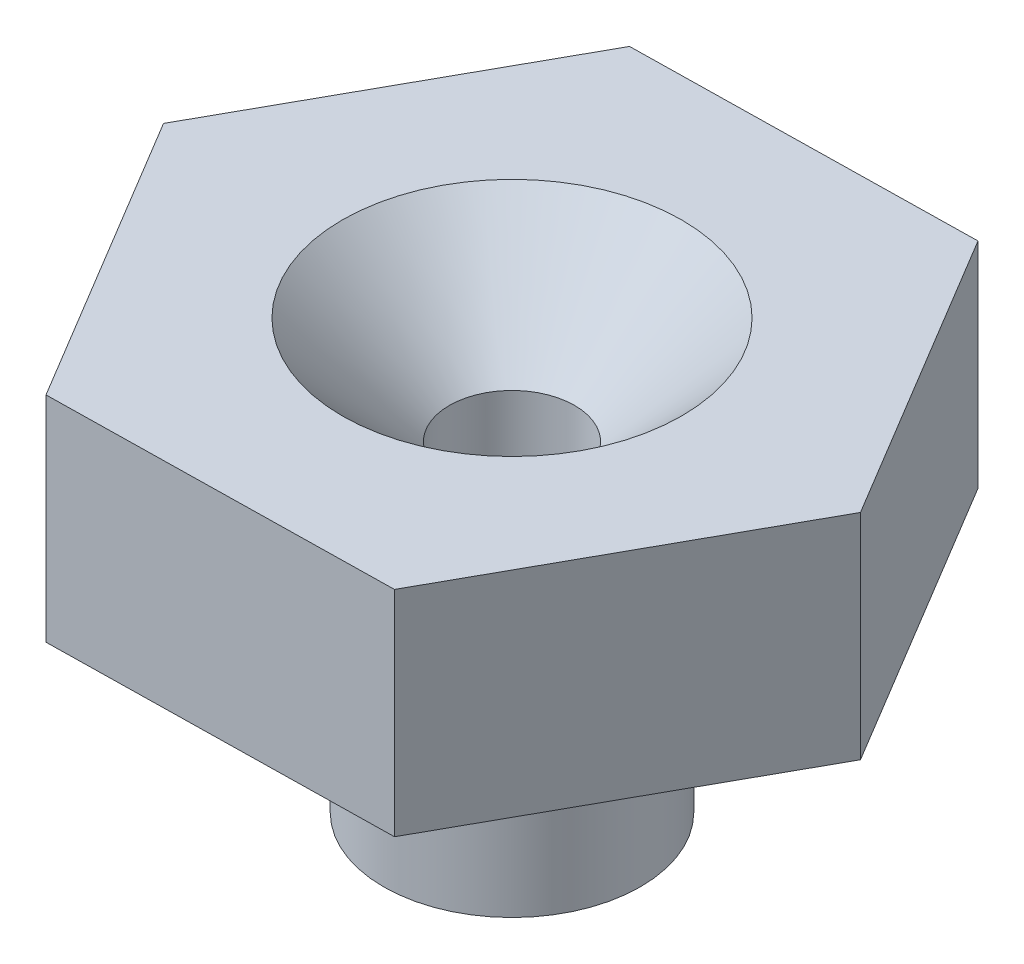
ISO-10303-21;
HEADER;
FILE_DESCRIPTION(('STEP AP214'),'2;1');
FILE_NAME('part.step','',(''),(''),'','','');
FILE_SCHEMA(('AUTOMOTIVE_DESIGN { 1 0 10303 214 1 1 1 1 }'));
ENDSEC;
DATA;
#1=APPLICATION_CONTEXT('core data for automotive mechanical design processes');
#2=APPLICATION_PROTOCOL_DEFINITION('international standard','automotive_design',2000,#1);
#3=PRODUCT_CONTEXT('',#1,'mechanical');
#4=PRODUCT('Part','Part','',(#3));
#5=PRODUCT_RELATED_PRODUCT_CATEGORY('part','',(#4));
#6=PRODUCT_DEFINITION_FORMATION('','',#4);
#7=PRODUCT_DEFINITION_CONTEXT('part definition',#1,'design');
#8=PRODUCT_DEFINITION('design','',#6,#7);
#9=PRODUCT_DEFINITION_SHAPE('','',#8);
#10=(LENGTH_UNIT() NAMED_UNIT(*) SI_UNIT(.MILLI.,.METRE.));
#11=(NAMED_UNIT(*) PLANE_ANGLE_UNIT() SI_UNIT($,.RADIAN.));
#12=(NAMED_UNIT(*) SI_UNIT($,.STERADIAN.) SOLID_ANGLE_UNIT());
#13=UNCERTAINTY_MEASURE_WITH_UNIT(LENGTH_MEASURE(1.E-05),#10,'distance_accuracy_value','');
#14=(GEOMETRIC_REPRESENTATION_CONTEXT(3) GLOBAL_UNCERTAINTY_ASSIGNED_CONTEXT((#13)) GLOBAL_UNIT_ASSIGNED_CONTEXT((#10,
#11,#12)) REPRESENTATION_CONTEXT('',''));
#15=CARTESIAN_POINT('',(0.,0.,0.));
#16=DIRECTION('',(0.,0.,1.));
#17=DIRECTION('',(1.,0.,0.));
#18=AXIS2_PLACEMENT_3D('',#15,#16,#17);
#19=CARTESIAN_POINT('',(-0.23391674633456,10.,-13.8544318885975));
#20=DIRECTION('',(0.0168814870580272,0.,0.999857497543894));
#21=DIRECTION('',(0.999857497543894,0.,-0.0168814870580272));
#22=AXIS2_PLACEMENT_3D('',#19,#20,#21);
#23=PLANE('',#22);
#24=DIRECTION('',(-0.999857497543894,0.,0.0168814870580272));
#25=VECTOR('',#24,1.);
#26=CARTESIAN_POINT('',(-0.233916746334582,0.,-13.8544318885976));
#27=LINE('',#26,#25);
#28=CARTESIAN_POINT('',(7.76494323401657,0.,-13.9894837850619));
#29=VERTEX_POINT('',#28);
#30=CARTESIAN_POINT('',(-8.23277672668571,0.,-13.7193799921332));
#31=VERTEX_POINT('',#30);
#32=EDGE_CURVE('E135',#29,#31,#27,.T.);
#33=ORIENTED_EDGE('',*,*,#32,.T.);
#34=DIRECTION('',(0.,-1.,0.));
#35=VECTOR('',#34,1.);
#36=CARTESIAN_POINT('',(-8.23277672668571,10.,-13.7193799921332));
#37=LINE('',#36,#35);
#38=CARTESIAN_POINT('',(-8.23277672668571,10.,-13.7193799921332));
#39=VERTEX_POINT('',#38);
#40=EDGE_CURVE('E163',#39,#31,#37,.T.);
#41=ORIENTED_EDGE('',*,*,#40,.F.);
#42=DIRECTION('',(-0.999857497543894,0.,0.0168814870580272));
#43=VECTOR('',#42,1.);
#44=CARTESIAN_POINT('',(-0.23391674633456,10.,-13.8544318885975));
#45=LINE('',#44,#43);
#46=CARTESIAN_POINT('',(7.76494323401657,10.,-13.9894837850619));
#47=VERTEX_POINT('',#46);
#48=EDGE_CURVE('E152',#47,#39,#45,.T.);
#49=ORIENTED_EDGE('',*,*,#48,.F.);
#50=DIRECTION('',(0.,-1.,0.));
#51=VECTOR('',#50,1.);
#52=CARTESIAN_POINT('',(7.76494323401657,10.,-13.9894837850619));
#53=LINE('',#52,#51);
#54=EDGE_CURVE('E131',#47,#29,#53,.T.);
#55=ORIENTED_EDGE('',*,*,#54,.T.);
#56=EDGE_LOOP('',(#33,#41,#49,#55));
#57=FACE_BOUND('',#56,.T.);
#58=ADVANCED_FACE('F42',(#57),#23,.F.);
#59=CARTESIAN_POINT('',(-12.115248343694,10.,-6.72463809960256));
#60=DIRECTION('',(0.874342736566363,0.,0.485308952126038));
#61=DIRECTION('',(0.485308952126038,0.,-0.874342736566363));
#62=AXIS2_PLACEMENT_3D('',#59,#60,#61);
#63=PLANE('',#62);
#64=DIRECTION('',(-0.485308952126038,0.,0.874342736566363));
#65=VECTOR('',#64,1.);
#66=CARTESIAN_POINT('',(-12.1152483436941,0.,-6.72463809960253));
#67=LINE('',#66,#65);
#68=CARTESIAN_POINT('',(-15.9977199607024,0.,0.270103792928383));
#69=VERTEX_POINT('',#68);
#70=EDGE_CURVE('E139',#31,#69,#67,.T.);
#71=ORIENTED_EDGE('',*,*,#70,.T.);
#72=DIRECTION('',(0.,-1.,0.));
#73=VECTOR('',#72,1.);
#74=CARTESIAN_POINT('',(-15.9977199607024,10.,0.270103792928411));
#75=LINE('',#74,#73);
#76=CARTESIAN_POINT('',(-15.9977199607024,10.,0.270103792928411));
#77=VERTEX_POINT('',#76);
#78=EDGE_CURVE('E159',#77,#69,#75,.T.);
#79=ORIENTED_EDGE('',*,*,#78,.F.);
#80=DIRECTION('',(-0.485308952126038,0.,0.874342736566363));
#81=VECTOR('',#80,1.);
#82=CARTESIAN_POINT('',(-12.115248343694,10.,-6.72463809960256));
#83=LINE('',#82,#81);
#84=EDGE_CURVE('E99',#39,#77,#83,.T.);
#85=ORIENTED_EDGE('',*,*,#84,.F.);
#86=ORIENTED_EDGE('',*,*,#40,.T.);
#87=EDGE_LOOP('',(#71,#79,#85,#86));
#88=FACE_BOUND('',#87,.T.);
#89=ADVANCED_FACE('F189',(#88),#63,.F.);
#90=CARTESIAN_POINT('',(-11.8813315973595,10.,7.12979378899498));
#91=DIRECTION('',(0.857461249508335,0.,-0.514548545417857));
#92=DIRECTION('',(-0.514548545417857,0.,-0.857461249508335));
#93=AXIS2_PLACEMENT_3D('',#90,#91,#92);
#94=PLANE('',#93);
#95=DIRECTION('',(0.514548545417857,0.,0.857461249508335));
#96=VECTOR('',#95,1.);
#97=CARTESIAN_POINT('',(-11.8813315973595,0.,7.12979378899498));
#98=LINE('',#97,#96);
#99=CARTESIAN_POINT('',(-7.76494323401664,-1.11022302462516E-13,13.9894837850618));
#100=VERTEX_POINT('',#99);
#101=EDGE_CURVE('E143',#69,#100,#98,.T.);
#102=ORIENTED_EDGE('',*,*,#101,.T.);
#103=DIRECTION('',(0.,-1.,0.));
#104=VECTOR('',#103,1.);
#105=CARTESIAN_POINT('',(-7.76494323401664,9.9999999999999,13.9894837850618));
#106=LINE('',#105,#104);
#107=CARTESIAN_POINT('',(-7.76494323401664,9.9999999999999,13.9894837850618));
#108=VERTEX_POINT('',#107);
#109=EDGE_CURVE('E123',#108,#100,#106,.T.);
#110=ORIENTED_EDGE('',*,*,#109,.F.);
#111=DIRECTION('',(0.514548545417857,0.,0.857461249508335));
#112=VECTOR('',#111,1.);
#113=CARTESIAN_POINT('',(-11.8813315973595,10.,7.12979378899498));
#114=LINE('',#113,#112);
#115=EDGE_CURVE('E112',#77,#108,#114,.T.);
#116=ORIENTED_EDGE('',*,*,#115,.F.);
#117=ORIENTED_EDGE('',*,*,#78,.T.);
#118=EDGE_LOOP('',(#102,#110,#116,#117));
#119=FACE_BOUND('',#118,.T.);
#120=ADVANCED_FACE('F195',(#119),#94,.F.);
#121=CARTESIAN_POINT('',(0.233916746334519,9.9999999999999,13.8544318885974));
#122=DIRECTION('',(-0.0168814870580271,0.,-0.999857497543894));
#123=DIRECTION('',(-0.999857497543894,0.,0.0168814870580271));
#124=AXIS2_PLACEMENT_3D('',#121,#122,#123);
#125=PLANE('',#124);
#126=DIRECTION('',(0.999857497543894,0.,-0.0168814870580271));
#127=VECTOR('',#126,1.);
#128=CARTESIAN_POINT('',(0.233916746334519,-1.11022302462516E-13,13.8544318885974));
#129=LINE('',#128,#127);
#130=CARTESIAN_POINT('',(8.23277672668569,-1.11022302462516E-13,13.7193799921334));
#131=VERTEX_POINT('',#130);
#132=EDGE_CURVE('E121',#100,#131,#129,.T.);
#133=ORIENTED_EDGE('',*,*,#132,.T.);
#134=DIRECTION('',(0.,-1.,0.));
#135=VECTOR('',#134,1.);
#136=CARTESIAN_POINT('',(8.23277672668569,9.9999999999999,13.7193799921334));
#137=LINE('',#136,#135);
#138=CARTESIAN_POINT('',(8.23277672668569,9.9999999999999,13.7193799921334));
#139=VERTEX_POINT('',#138);
#140=EDGE_CURVE('E118',#139,#131,#137,.T.);
#141=ORIENTED_EDGE('',*,*,#140,.F.);
#142=DIRECTION('',(0.999857497543894,0.,-0.0168814870580271));
#143=VECTOR('',#142,1.);
#144=CARTESIAN_POINT('',(0.233916746334519,9.9999999999999,13.8544318885974));
#145=LINE('',#144,#143);
#146=EDGE_CURVE('E106',#108,#139,#145,.T.);
#147=ORIENTED_EDGE('',*,*,#146,.F.);
#148=ORIENTED_EDGE('',*,*,#109,.T.);
#149=EDGE_LOOP('',(#133,#141,#147,#148));
#150=FACE_BOUND('',#149,.T.);
#151=ADVANCED_FACE('F119',(#150),#125,.F.);
#152=CARTESIAN_POINT('',(12.115248343694,10.,6.72463809960247));
#153=DIRECTION('',(-0.874342736566363,0.,-0.485308952126038));
#154=DIRECTION('',(-0.485308952126038,0.,0.874342736566363));
#155=AXIS2_PLACEMENT_3D('',#152,#153,#154);
#156=PLANE('',#155);
#157=DIRECTION('',(0.485308952126038,0.,-0.874342736566363));
#158=VECTOR('',#157,1.);
#159=CARTESIAN_POINT('',(12.115248343694,0.,6.72463809960247));
#160=LINE('',#159,#158);
#161=CARTESIAN_POINT('',(15.9977199607023,0.,-0.270103792928321));
#162=VERTEX_POINT('',#161);
#163=EDGE_CURVE('E84',#131,#162,#160,.T.);
#164=ORIENTED_EDGE('',*,*,#163,.T.);
#165=DIRECTION('',(0.,-1.,0.));
#166=VECTOR('',#165,1.);
#167=CARTESIAN_POINT('',(15.9977199607023,10.,-0.270103792928245));
#168=LINE('',#167,#166);
#169=CARTESIAN_POINT('',(15.9977199607023,10.,-0.270103792928245));
#170=VERTEX_POINT('',#169);
#171=EDGE_CURVE('E124',#170,#162,#168,.T.);
#172=ORIENTED_EDGE('',*,*,#171,.F.);
#173=DIRECTION('',(0.485308952126038,0.,-0.874342736566363));
#174=VECTOR('',#173,1.);
#175=CARTESIAN_POINT('',(12.115248343694,10.,6.72463809960247));
#176=LINE('',#175,#174);
#177=EDGE_CURVE('E110',#139,#170,#176,.T.);
#178=ORIENTED_EDGE('',*,*,#177,.F.);
#179=ORIENTED_EDGE('',*,*,#140,.T.);
#180=EDGE_LOOP('',(#164,#172,#178,#179));
#181=FACE_BOUND('',#180,.T.);
#182=ADVANCED_FACE('F126',(#181),#156,.F.);
#183=CARTESIAN_POINT('',(11.8813315973594,10.,-7.12979378899503));
#184=DIRECTION('',(-0.857461249508335,0.,0.514548545417857));
#185=DIRECTION('',(0.514548545417857,0.,0.857461249508335));
#186=AXIS2_PLACEMENT_3D('',#183,#184,#185);
#187=PLANE('',#186);
#188=DIRECTION('',(-0.514548545417857,0.,-0.857461249508335));
#189=VECTOR('',#188,1.);
#190=CARTESIAN_POINT('',(11.8813315973594,0.,-7.12979378899506));
#191=LINE('',#190,#189);
#192=EDGE_CURVE('E90',#162,#29,#191,.T.);
#193=ORIENTED_EDGE('',*,*,#192,.T.);
#194=ORIENTED_EDGE('',*,*,#54,.F.);
#195=DIRECTION('',(-0.514548545417857,0.,-0.857461249508335));
#196=VECTOR('',#195,1.);
#197=CARTESIAN_POINT('',(11.8813315973594,10.,-7.12979378899503));
#198=LINE('',#197,#196);
#199=EDGE_CURVE('E61',#170,#47,#198,.T.);
#200=ORIENTED_EDGE('',*,*,#199,.F.);
#201=ORIENTED_EDGE('',*,*,#171,.T.);
#202=EDGE_LOOP('',(#193,#194,#200,#201));
#203=FACE_BOUND('',#202,.T.);
#204=ADVANCED_FACE('F205',(#203),#187,.F.);
#205=CARTESIAN_POINT('',(0.,10.,0.));
#206=DIRECTION('',(0.,1.,0.));
#207=DIRECTION('',(0.,0.,1.00000000000001));
#208=AXIS2_PLACEMENT_3D('',#205,#206,#207);
#209=PLANE('',#208);
#210=CARTESIAN_POINT('',(0.,10.,0.));
#211=DIRECTION('',(0.,1.,0.));
#212=DIRECTION('',(0.,0.,1.00000000000001));
#213=AXIS2_PLACEMENT_3D('',#210,#211,#212);
#214=CIRCLE('',#213,7.92499999999999);
#215=CARTESIAN_POINT('',(0.,10.,7.9250000000001));
#216=VERTEX_POINT('',#215);
#217=EDGE_CURVE('E53',#216,#216,#214,.F.);
#218=ORIENTED_EDGE('',*,*,#217,.T.);
#219=EDGE_LOOP('',(#218));
#220=FACE_BOUND('',#219,.T.);
#221=ORIENTED_EDGE('',*,*,#48,.T.);
#222=ORIENTED_EDGE('',*,*,#84,.T.);
#223=ORIENTED_EDGE('',*,*,#115,.T.);
#224=ORIENTED_EDGE('',*,*,#146,.T.);
#225=ORIENTED_EDGE('',*,*,#177,.T.);
#226=ORIENTED_EDGE('',*,*,#199,.T.);
#227=EDGE_LOOP('',(#221,#222,#223,#224,#225,#226));
#228=FACE_BOUND('',#227,.T.);
#229=ADVANCED_FACE('F108',(#220,#228),#209,.T.);
#230=CARTESIAN_POINT('',(0.,0.,0.));
#231=DIRECTION('',(0.,1.,0.));
#232=DIRECTION('',(0.,0.,1.00000000000001));
#233=AXIS2_PLACEMENT_3D('',#230,#231,#232);
#234=PLANE('',#233);
#235=CARTESIAN_POINT('',(0.,0.,0.));
#236=DIRECTION('',(0.,1.,0.));
#237=DIRECTION('',(0.,0.,1.00000000000001));
#238=AXIS2_PLACEMENT_3D('',#235,#236,#237);
#239=CIRCLE('',#238,10.);
#240=CARTESIAN_POINT('',(0.,0.,10.0000000000001));
#241=VERTEX_POINT('',#240);
#242=EDGE_CURVE('E170',#241,#241,#239,.T.);
#243=ORIENTED_EDGE('',*,*,#242,.T.);
#244=EDGE_LOOP('',(#243));
#245=FACE_BOUND('',#244,.T.);
#246=ORIENTED_EDGE('',*,*,#32,.F.);
#247=ORIENTED_EDGE('',*,*,#192,.F.);
#248=ORIENTED_EDGE('',*,*,#163,.F.);
#249=ORIENTED_EDGE('',*,*,#132,.F.);
#250=ORIENTED_EDGE('',*,*,#101,.F.);
#251=ORIENTED_EDGE('',*,*,#70,.F.);
#252=EDGE_LOOP('',(#246,#247,#248,#249,#250,#251));
#253=FACE_BOUND('',#252,.T.);
#254=ADVANCED_FACE('F208',(#245,#253),#234,.F.);
#255=CARTESIAN_POINT('',(0.,-10.,0.));
#256=DIRECTION('',(0.,1.,0.));
#257=DIRECTION('',(0.,0.,1.00000000000001));
#258=AXIS2_PLACEMENT_3D('',#255,#256,#257);
#259=CYLINDRICAL_SURFACE('',#258,6.);
#260=CARTESIAN_POINT('',(0.,-4.,0.));
#261=DIRECTION('',(0.,1.,0.));
#262=DIRECTION('',(0.,0.,1.00000000000001));
#263=AXIS2_PLACEMENT_3D('',#260,#261,#262);
#264=CIRCLE('',#263,6.);
#265=CARTESIAN_POINT('',(0.,-4.,6.00000000000008));
#266=VERTEX_POINT('',#265);
#267=EDGE_CURVE('E166',#266,#266,#264,.F.);
#268=ORIENTED_EDGE('',*,*,#267,.T.);
#269=EDGE_LOOP('',(#268));
#270=FACE_BOUND('',#269,.T.);
#271=CARTESIAN_POINT('',(0.,-10.,0.));
#272=DIRECTION('',(0.,-1.,0.));
#273=DIRECTION('',(0.,0.,-1.00000000000001));
#274=AXIS2_PLACEMENT_3D('',#271,#272,#273);
#275=CIRCLE('',#274,6.);
#276=CARTESIAN_POINT('',(0.,-10.,-6.00000000000008));
#277=VERTEX_POINT('',#276);
#278=EDGE_CURVE('E140',#277,#277,#275,.T.);
#279=ORIENTED_EDGE('',*,*,#278,.F.);
#280=EDGE_LOOP('',(#279));
#281=FACE_BOUND('',#280,.T.);
#282=ADVANCED_FACE('F211',(#270,#281),#259,.T.);
#283=CARTESIAN_POINT('',(0.,-10.,0.));
#284=DIRECTION('',(0.,-1.,0.));
#285=DIRECTION('',(0.,0.,-1.00000000000001));
#286=AXIS2_PLACEMENT_3D('',#283,#284,#285);
#287=PLANE('',#286);
#288=CARTESIAN_POINT('',(0.,-10.,0.));
#289=DIRECTION('',(0.,-1.,0.));
#290=DIRECTION('',(0.,0.,-1.00000000000001));
#291=AXIS2_PLACEMENT_3D('',#288,#289,#290);
#292=CIRCLE('',#291,2.925);
#293=CARTESIAN_POINT('',(0.,-10.,-2.92500000000004));
#294=VERTEX_POINT('',#293);
#295=EDGE_CURVE('E229',#294,#294,#292,.T.);
#296=ORIENTED_EDGE('',*,*,#295,.F.);
#297=EDGE_LOOP('',(#296));
#298=FACE_BOUND('',#297,.T.);
#299=ORIENTED_EDGE('',*,*,#278,.T.);
#300=EDGE_LOOP('',(#299));
#301=FACE_BOUND('',#300,.T.);
#302=ADVANCED_FACE('F217',(#298,#301),#287,.T.);
#303=CARTESIAN_POINT('',(0.,10.,0.));
#304=DIRECTION('',(0.,-1.,0.));
#305=DIRECTION('',(0.,0.,-1.00000000000001));
#306=AXIS2_PLACEMENT_3D('',#303,#304,#305);
#307=CYLINDRICAL_SURFACE('',#306,2.925);
#308=CARTESIAN_POINT('',(0.,4.99999999999998,0.));
#309=DIRECTION('',(0.,1.,0.));
#310=DIRECTION('',(0.,0.,1.00000000000001));
#311=AXIS2_PLACEMENT_3D('',#308,#309,#310);
#312=CIRCLE('',#311,2.925);
#313=CARTESIAN_POINT('',(0.,4.99999999999998,2.92500000000004));
#314=VERTEX_POINT('',#313);
#315=EDGE_CURVE('E11',#314,#314,#312,.T.);
#316=ORIENTED_EDGE('',*,*,#315,.T.);
#317=EDGE_LOOP('',(#316));
#318=FACE_BOUND('',#317,.T.);
#319=ORIENTED_EDGE('',*,*,#295,.T.);
#320=EDGE_LOOP('',(#319));
#321=FACE_BOUND('',#320,.T.);
#322=ADVANCED_FACE('F185',(#318,#321),#307,.F.);
#323=CARTESIAN_POINT('',(0.,-4.,0.));
#324=DIRECTION('',(0.,1.,0.));
#325=DIRECTION('',(0.,0.,1.00000000000001));
#326=AXIS2_PLACEMENT_3D('',#323,#324,#325);
#327=TOROIDAL_SURFACE('',#326,10.,4.);
#328=ORIENTED_EDGE('',*,*,#242,.F.);
#329=EDGE_LOOP('',(#328));
#330=FACE_BOUND('',#329,.T.);
#331=ORIENTED_EDGE('',*,*,#267,.F.);
#332=EDGE_LOOP('',(#331));
#333=FACE_BOUND('',#332,.T.);
#334=ADVANCED_FACE('F180',(#330,#333),#327,.F.);
#335=CARTESIAN_POINT('',(0.,10.,0.));
#336=DIRECTION('',(0.,1.,0.));
#337=DIRECTION('',(0.,0.,1.00000000000001));
#338=AXIS2_PLACEMENT_3D('',#335,#336,#337);
#339=CONICAL_SURFACE('',#338,7.92499999999999,0.785398163397447);
#340=ORIENTED_EDGE('',*,*,#315,.F.);
#341=EDGE_LOOP('',(#340));
#342=FACE_BOUND('',#341,.T.);
#343=ORIENTED_EDGE('',*,*,#217,.F.);
#344=EDGE_LOOP('',(#343));
#345=FACE_BOUND('',#344,.T.);
#346=ADVANCED_FACE('F45',(#342,#345),#339,.F.);
#347=CLOSED_SHELL('',(#58,#89,#120,#151,#182,#204,#229,#254,#282,#302,#322,#334,#346));
#348=MANIFOLD_SOLID_BREP('B2',#347);
#349=ADVANCED_BREP_SHAPE_REPRESENTATION('',(#18,#348),#14);
#350=SHAPE_DEFINITION_REPRESENTATION(#9,#349);
ENDSEC;
END-ISO-10303-21;
